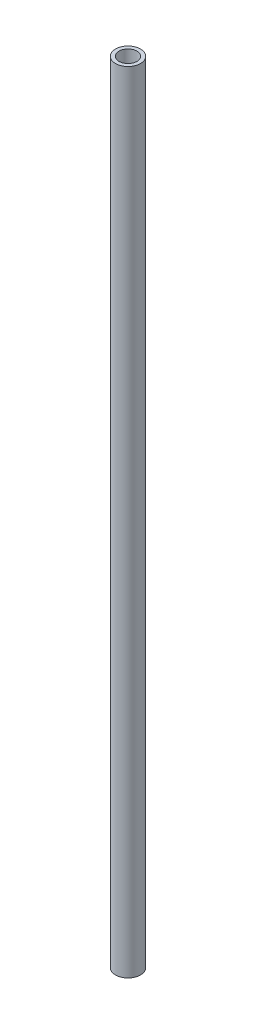
ISO-10303-21;
HEADER;
FILE_DESCRIPTION(('STEP AP214'),'2;1');
FILE_NAME('part.step','',(''),(''),'','','');
FILE_SCHEMA(('AUTOMOTIVE_DESIGN { 1 0 10303 214 1 1 1 1 }'));
ENDSEC;
DATA;
#1=APPLICATION_CONTEXT('core data for automotive mechanical design processes');
#2=APPLICATION_PROTOCOL_DEFINITION('international standard','automotive_design',2000,#1);
#3=PRODUCT_CONTEXT('',#1,'mechanical');
#4=PRODUCT('Part','Part','',(#3));
#5=PRODUCT_RELATED_PRODUCT_CATEGORY('part','',(#4));
#6=PRODUCT_DEFINITION_FORMATION('','',#4);
#7=PRODUCT_DEFINITION_CONTEXT('part definition',#1,'design');
#8=PRODUCT_DEFINITION('design','',#6,#7);
#9=PRODUCT_DEFINITION_SHAPE('','',#8);
#10=(LENGTH_UNIT() NAMED_UNIT(*) SI_UNIT(.MILLI.,.METRE.));
#11=(NAMED_UNIT(*) PLANE_ANGLE_UNIT() SI_UNIT($,.RADIAN.));
#12=(NAMED_UNIT(*) SI_UNIT($,.STERADIAN.) SOLID_ANGLE_UNIT());
#13=UNCERTAINTY_MEASURE_WITH_UNIT(LENGTH_MEASURE(1.E-05),#10,'distance_accuracy_value','');
#14=(GEOMETRIC_REPRESENTATION_CONTEXT(3) GLOBAL_UNCERTAINTY_ASSIGNED_CONTEXT((#13)) GLOBAL_UNIT_ASSIGNED_CONTEXT((#10,
#11,#12)) REPRESENTATION_CONTEXT('',''));
#15=CARTESIAN_POINT('',(0.,0.,0.));
#16=DIRECTION('',(0.,0.,1.));
#17=DIRECTION('',(1.,0.,0.));
#18=AXIS2_PLACEMENT_3D('',#15,#16,#17);
#19=CARTESIAN_POINT('',(0.,110.,0.));
#20=DIRECTION('',(0.,1.,0.));
#21=DIRECTION('',(0.,0.,1.));
#22=AXIS2_PLACEMENT_3D('',#19,#20,#21);
#23=PLANE('',#22);
#24=CARTESIAN_POINT('',(0.,110.,0.));
#25=DIRECTION('',(0.,1.,0.));
#26=DIRECTION('',(0.,0.,1.));
#27=AXIS2_PLACEMENT_3D('',#24,#25,#26);
#28=CIRCLE('',#27,3.5);
#29=CARTESIAN_POINT('',(0.,110.,3.5));
#30=VERTEX_POINT('',#29);
#31=EDGE_CURVE('E10',#30,#30,#28,.T.);
#32=ORIENTED_EDGE('',*,*,#31,.T.);
#33=EDGE_LOOP('',(#32));
#34=FACE_BOUND('',#33,.T.);
#35=CARTESIAN_POINT('',(0.,110.,0.));
#36=DIRECTION('',(0.,1.,0.));
#37=DIRECTION('',(0.,0.,1.));
#38=AXIS2_PLACEMENT_3D('',#35,#36,#37);
#39=CIRCLE('',#38,2.5);
#40=CARTESIAN_POINT('',(0.,110.,2.5));
#41=VERTEX_POINT('',#40);
#42=EDGE_CURVE('E44',#41,#41,#39,.T.);
#43=ORIENTED_EDGE('',*,*,#42,.F.);
#44=EDGE_LOOP('',(#43));
#45=FACE_BOUND('',#44,.T.);
#46=ADVANCED_FACE('F33',(#34,#45),#23,.T.);
#47=CARTESIAN_POINT('',(0.,-110.,0.));
#48=DIRECTION('',(0.,1.,0.));
#49=DIRECTION('',(0.,0.,1.));
#50=AXIS2_PLACEMENT_3D('',#47,#48,#49);
#51=PLANE('',#50);
#52=CARTESIAN_POINT('',(0.,-110.,0.));
#53=DIRECTION('',(0.,1.,0.));
#54=DIRECTION('',(0.,0.,1.));
#55=AXIS2_PLACEMENT_3D('',#52,#53,#54);
#56=CIRCLE('',#55,3.5);
#57=CARTESIAN_POINT('',(0.,-110.,3.5));
#58=VERTEX_POINT('',#57);
#59=EDGE_CURVE('E37',#58,#58,#56,.T.);
#60=ORIENTED_EDGE('',*,*,#59,.F.);
#61=EDGE_LOOP('',(#60));
#62=FACE_BOUND('',#61,.T.);
#63=CARTESIAN_POINT('',(0.,-110.,0.));
#64=DIRECTION('',(0.,1.,0.));
#65=DIRECTION('',(0.,0.,1.));
#66=AXIS2_PLACEMENT_3D('',#63,#64,#65);
#67=CIRCLE('',#66,2.5);
#68=CARTESIAN_POINT('',(0.,-110.,2.5));
#69=VERTEX_POINT('',#68);
#70=EDGE_CURVE('E46',#69,#69,#67,.T.);
#71=ORIENTED_EDGE('',*,*,#70,.T.);
#72=EDGE_LOOP('',(#71));
#73=FACE_BOUND('',#72,.T.);
#74=ADVANCED_FACE('F56',(#62,#73),#51,.F.);
#75=CARTESIAN_POINT('',(0.,110.,0.));
#76=DIRECTION('',(0.,-1.,0.));
#77=DIRECTION('',(0.,0.,-1.));
#78=AXIS2_PLACEMENT_3D('',#75,#76,#77);
#79=CYLINDRICAL_SURFACE('',#78,3.5);
#80=ORIENTED_EDGE('',*,*,#31,.F.);
#81=EDGE_LOOP('',(#80));
#82=FACE_BOUND('',#81,.T.);
#83=ORIENTED_EDGE('',*,*,#59,.T.);
#84=EDGE_LOOP('',(#83));
#85=FACE_BOUND('',#84,.T.);
#86=ADVANCED_FACE('F35',(#82,#85),#79,.T.);
#87=CARTESIAN_POINT('',(0.,110.,0.));
#88=DIRECTION('',(0.,-1.,0.));
#89=DIRECTION('',(0.,0.,-1.));
#90=AXIS2_PLACEMENT_3D('',#87,#88,#89);
#91=CYLINDRICAL_SURFACE('',#90,2.5);
#92=ORIENTED_EDGE('',*,*,#42,.T.);
#93=EDGE_LOOP('',(#92));
#94=FACE_BOUND('',#93,.T.);
#95=ORIENTED_EDGE('',*,*,#70,.F.);
#96=EDGE_LOOP('',(#95));
#97=FACE_BOUND('',#96,.T.);
#98=ADVANCED_FACE('F52',(#94,#97),#91,.F.);
#99=CLOSED_SHELL('',(#46,#74,#86,#98));
#100=MANIFOLD_SOLID_BREP('B2',#99);
#101=ADVANCED_BREP_SHAPE_REPRESENTATION('',(#18,#100),#14);
#102=SHAPE_DEFINITION_REPRESENTATION(#9,#101);
ENDSEC;
END-ISO-10303-21;
